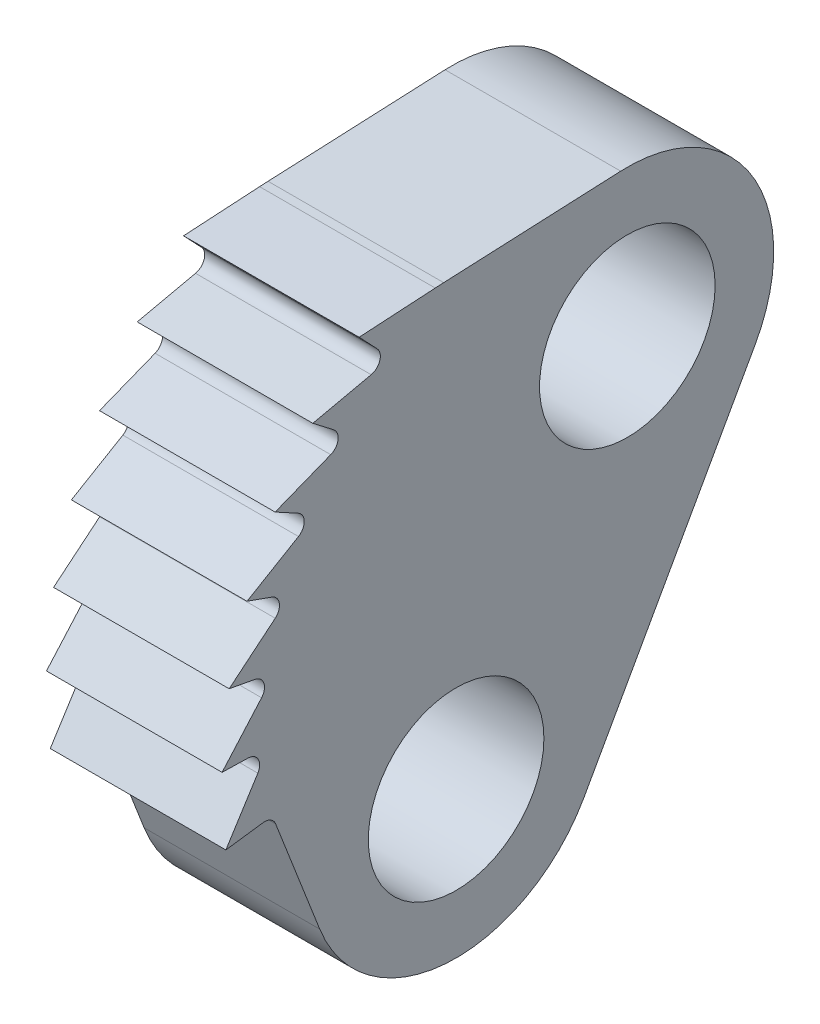
ISO-10303-21;
HEADER;
FILE_DESCRIPTION(('STEP AP214'),'2;1');
FILE_NAME('part.step','',(''),(''),'','','');
FILE_SCHEMA(('AUTOMOTIVE_DESIGN { 1 0 10303 214 1 1 1 1 }'));
ENDSEC;
DATA;
#1=APPLICATION_CONTEXT('core data for automotive mechanical design processes');
#2=APPLICATION_PROTOCOL_DEFINITION('international standard','automotive_design',2000,#1);
#3=PRODUCT_CONTEXT('',#1,'mechanical');
#4=PRODUCT('Part','Part','',(#3));
#5=PRODUCT_RELATED_PRODUCT_CATEGORY('part','',(#4));
#6=PRODUCT_DEFINITION_FORMATION('','',#4);
#7=PRODUCT_DEFINITION_CONTEXT('part definition',#1,'design');
#8=PRODUCT_DEFINITION('design','',#6,#7);
#9=PRODUCT_DEFINITION_SHAPE('','',#8);
#10=(LENGTH_UNIT() NAMED_UNIT(*) SI_UNIT(.MILLI.,.METRE.));
#11=(NAMED_UNIT(*) PLANE_ANGLE_UNIT() SI_UNIT($,.RADIAN.));
#12=(NAMED_UNIT(*) SI_UNIT($,.STERADIAN.) SOLID_ANGLE_UNIT());
#13=UNCERTAINTY_MEASURE_WITH_UNIT(LENGTH_MEASURE(1.E-05),#10,'distance_accuracy_value','');
#14=(GEOMETRIC_REPRESENTATION_CONTEXT(3) GLOBAL_UNCERTAINTY_ASSIGNED_CONTEXT((#13)) GLOBAL_UNIT_ASSIGNED_CONTEXT((#10,
#11,#12)) REPRESENTATION_CONTEXT('',''));
#15=CARTESIAN_POINT('',(0.,0.,0.));
#16=DIRECTION('',(0.,0.,1.));
#17=DIRECTION('',(1.,0.,0.));
#18=AXIS2_PLACEMENT_3D('',#15,#16,#17);
#19=CARTESIAN_POINT('',(3.,-42.7343691654933,-38.9249991557742));
#20=DIRECTION('',(1.,0.,0.));
#21=DIRECTION('',(0.,0.,-1.));
#22=AXIS2_PLACEMENT_3D('',#19,#20,#21);
#23=PLANE('',#22);
#24=CARTESIAN_POINT('',(3.,-42.7343691654933,-38.9249991557742));
#25=DIRECTION('',(1.,0.,0.));
#26=DIRECTION('',(0.,0.,-1.));
#27=AXIS2_PLACEMENT_3D('',#24,#25,#26);
#28=CIRCLE('',#27,1.5);
#29=CARTESIAN_POINT('',(3.,-42.7343691654933,-40.4249991557742));
#30=VERTEX_POINT('',#29);
#31=EDGE_CURVE('E268',#30,#30,#28,.T.);
#32=ORIENTED_EDGE('',*,*,#31,.F.);
#33=EDGE_LOOP('',(#32));
#34=FACE_BOUND('',#33,.T.);
#35=DIRECTION('',(0.,-0.0454217464709889,0.998967899858412));
#36=VECTOR('',#35,1.);
#37=CARTESIAN_POINT('',(3.,-40.3777241266152,-35.7153635488899));
#38=LINE('',#37,#36);
#39=CARTESIAN_POINT('',(3.,-40.2369494158473,-38.8114447895967));
#40=VERTEX_POINT('',#39);
#41=CARTESIAN_POINT('',(3.,-40.3744405098739,-35.7875806689886));
#42=VERTEX_POINT('',#41);
#43=EDGE_CURVE('E245',#40,#42,#38,.T.);
#44=ORIENTED_EDGE('',*,*,#43,.T.);
#45=CARTESIAN_POINT('',(3.,-50.364119508458,-36.2417981336986));
#46=DIRECTION('',(1.,0.,0.));
#47=DIRECTION('',(0.,0.,-1.));
#48=AXIS2_PLACEMENT_3D('',#45,#46,#47);
#49=CIRCLE('',#48,10.);
#50=CARTESIAN_POINT('',(3.,-40.382051485744,-35.6432014498545));
#51=VERTEX_POINT('',#50);
#52=EDGE_CURVE('E343',#42,#51,#49,.T.);
#53=ORIENTED_EDGE('',*,*,#52,.T.);
#54=DIRECTION('',(0.,-0.0598596683844021,0.998206802271408));
#55=VECTOR('',#54,1.);
#56=CARTESIAN_POINT('',(3.,-40.4599715138505,-34.3438240194672));
#57=LINE('',#56,#55);
#58=CARTESIAN_POINT('',(3.,-40.4599715138505,-34.3438240194672));
#59=VERTEX_POINT('',#58);
#60=EDGE_CURVE('E247',#51,#59,#57,.T.);
#61=ORIENTED_EDGE('',*,*,#60,.T.);
#62=DIRECTION('',(0.,-0.726193720806137,-0.687490130737699));
#63=VECTOR('',#62,1.);
#64=CARTESIAN_POINT('',(3.,-41.0409264904954,-34.8938161240574));
#65=LINE('',#64,#63);
#66=CARTESIAN_POINT('',(3.,-40.7844185622066,-34.650979172839));
#67=VERTEX_POINT('',#66);
#68=EDGE_CURVE('E249',#59,#67,#65,.T.);
#69=ORIENTED_EDGE('',*,*,#68,.T.);
#70=CARTESIAN_POINT('',(3.,-40.9219165883542,-34.5057404286777));
#71=DIRECTION('',(1.,0.,0.));
#72=DIRECTION('',(0.,0.,-1.));
#73=AXIS2_PLACEMENT_3D('',#70,#71,#72);
#74=CIRCLE('',#73,0.2);
#75=CARTESIAN_POINT('',(3.,-41.117198297231,-34.5489267017068));
#76=VERTEX_POINT('',#75);
#77=EDGE_CURVE('E379',#67,#76,#74,.F.);
#78=ORIENTED_EDGE('',*,*,#77,.T.);
#79=DIRECTION('',(0.,-0.215931365144971,0.97640854438428));
#80=VECTOR('',#79,1.);
#81=CARTESIAN_POINT('',(3.,-41.3376169180347,-33.5522274748499));
#82=LINE('',#81,#80);
#83=CARTESIAN_POINT('',(3.,-41.3376169180347,-33.5522274748499));
#84=VERTEX_POINT('',#83);
#85=EDGE_CURVE('E252',#76,#84,#82,.T.);
#86=ORIENTED_EDGE('',*,*,#85,.T.);
#87=DIRECTION('',(0.,-0.60917433358158,-0.793036336686685));
#88=VECTOR('',#87,1.);
#89=CARTESIAN_POINT('',(3.,-41.8249563849,-34.1866565441992));
#90=LINE('',#89,#88);
#91=CARTESIAN_POINT('',(3.,-41.6097823317558,-33.9065383030838));
#92=VERTEX_POINT('',#91);
#93=EDGE_CURVE('E254',#84,#92,#90,.T.);
#94=ORIENTED_EDGE('',*,*,#93,.T.);
#95=CARTESIAN_POINT('',(3.,-41.7683895990931,-33.7847034363675));
#96=DIRECTION('',(1.,0.,0.));
#97=DIRECTION('',(0.,0.,-1.));
#98=AXIS2_PLACEMENT_3D('',#95,#96,#97);
#99=CIRCLE('',#98,0.2);
#100=CARTESIAN_POINT('',(3.,-41.9544621205419,-33.8580315807714));
#101=VERTEX_POINT('',#100);
#102=EDGE_CURVE('E383',#92,#101,#99,.F.);
#103=ORIENTED_EDGE('',*,*,#102,.T.);
#104=DIRECTION('',(0.,-0.366640722019304,0.930362607243629));
#105=VECTOR('',#104,1.);
#106=CARTESIAN_POINT('',(3.,-42.3287219795656,-32.9083351686808));
#107=LINE('',#106,#105);
#108=CARTESIAN_POINT('',(3.,-42.3287219795656,-32.9083351686808));
#109=VERTEX_POINT('',#108);
#110=EDGE_CURVE('E257',#101,#109,#107,.T.);
#111=ORIENTED_EDGE('',*,*,#110,.T.);
#112=DIRECTION('',(0.,-0.47702699204412,-0.878888644175893));
#113=VECTOR('',#112,1.);
#114=CARTESIAN_POINT('',(3.,-42.710343573201,-33.6114460840215));
#115=LINE('',#114,#113);
#116=CARTESIAN_POINT('',(3.,-42.5418469283508,-33.3010028801559));
#117=VERTEX_POINT('',#116);
#118=EDGE_CURVE('E259',#109,#117,#115,.T.);
#119=ORIENTED_EDGE('',*,*,#118,.T.);
#120=CARTESIAN_POINT('',(3.,-42.7176246571859,-33.2055974817471));
#121=DIRECTION('',(1.,0.,0.));
#122=DIRECTION('',(0.,0.,-1.));
#123=AXIS2_PLACEMENT_3D('',#120,#121,#122);
#124=CIRCLE('',#123,0.2);
#125=CARTESIAN_POINT('',(3.,-42.8898671520671,-33.3072465002231));
#126=VERTEX_POINT('',#125);
#127=EDGE_CURVE('E387',#117,#126,#124,.F.);
#128=ORIENTED_EDGE('',*,*,#127,.T.);
#129=DIRECTION('',(0.,-0.508245092379615,0.861212474405728));
#130=VECTOR('',#129,1.);
#131=CARTESIAN_POINT('',(3.,-43.4086740526642,-32.4281372253846));
#132=LINE('',#131,#130);
#133=CARTESIAN_POINT('',(3.,-43.4086740526642,-32.4281372253846));
#134=VERTEX_POINT('',#133);
#135=EDGE_CURVE('E262',#126,#134,#132,.T.);
#136=ORIENTED_EDGE('',*,*,#135,.T.);
#137=DIRECTION('',(0.,-0.333033382297636,-0.942915036615387));
#138=VECTOR('',#137,1.);
#139=CARTESIAN_POINT('',(3.,-43.6751007585023,-33.1824692546769));
#140=LINE('',#139,#138);
#141=CARTESIAN_POINT('',(3.,-43.5574658898762,-32.8494104913402));
#142=VERTEX_POINT('',#141);
#143=EDGE_CURVE('E209',#134,#142,#140,.T.);
#144=ORIENTED_EDGE('',*,*,#143,.T.);
#145=CARTESIAN_POINT('',(3.,-43.7460488971992,-32.7828038148807));
#146=DIRECTION('',(1.,0.,0.));
#147=DIRECTION('',(0.,0.,-1.));
#148=AXIS2_PLACEMENT_3D('',#145,#146,#147);
#149=CIRCLE('',#148,0.2);
#150=CARTESIAN_POINT('',(3.,-43.9001839748717,-32.9102494026071));
#151=VERTEX_POINT('',#150);
#152=EDGE_CURVE('E205',#142,#151,#149,.F.);
#153=ORIENTED_EDGE('',*,*,#152,.T.);
#154=DIRECTION('',(0.,-0.637227938631926,0.770675388361991));
#155=VECTOR('',#154,1.);
#156=CARTESIAN_POINT('',(3.,-44.5506541058624,-32.1235586591105));
#157=LINE('',#156,#155);
#158=CARTESIAN_POINT('',(3.,-44.5506541058624,-32.1235586591105));
#159=VERTEX_POINT('',#158);
#160=EDGE_CURVE('E196',#151,#159,#157,.T.);
#161=ORIENTED_EDGE('',*,*,#160,.T.);
#162=DIRECTION('',(0.,-0.180769375204567,-0.983525512118598));
#163=VECTOR('',#162,1.);
#164=CARTESIAN_POINT('',(3.,-44.695269606026,-32.9103790688054));
#165=LINE('',#164,#163);
#166=CARTESIAN_POINT('',(3.,-44.6314178036718,-32.5629757736452));
#167=VERTEX_POINT('',#166);
#168=EDGE_CURVE('E201',#159,#167,#165,.T.);
#169=ORIENTED_EDGE('',*,*,#168,.T.);
#170=CARTESIAN_POINT('',(3.,-44.8281229060955,-32.5268218986042));
#171=DIRECTION('',(1.,0.,0.));
#172=DIRECTION('',(0.,0.,-1.));
#173=AXIS2_PLACEMENT_3D('',#170,#171,#172);
#174=CIRCLE('',#173,0.2);
#175=CARTESIAN_POINT('',(3.,-44.9603228471617,-32.6768991306618));
#176=VERTEX_POINT('',#175);
#177=EDGE_CURVE('E398',#167,#176,#174,.F.);
#178=ORIENTED_EDGE('',*,*,#177,.T.);
#179=DIRECTION('',(0.,-0.750386160288113,0.660999705331298));
#180=VECTOR('',#179,1.);
#181=CARTESIAN_POINT('',(3.,-45.7263027334551,-32.0021632334337));
#182=LINE('',#181,#180);
#183=CARTESIAN_POINT('',(3.,-45.7263027334551,-32.0021632334337));
#184=VERTEX_POINT('',#183);
#185=EDGE_CURVE('E225',#176,#184,#182,.T.);
#186=ORIENTED_EDGE('',*,*,#185,.T.);
#187=DIRECTION('',(0.,-0.0240162248588746,-0.999711568875507));
#188=VECTOR('',#187,1.);
#189=CARTESIAN_POINT('',(3.,-45.7455157133422,-32.8019324885341));
#190=LINE('',#189,#188);
#191=CARTESIAN_POINT('',(3.,-45.7370326434569,-32.4488119146824));
#192=VERTEX_POINT('',#191);
#193=EDGE_CURVE('E227',#184,#192,#190,.T.);
#194=ORIENTED_EDGE('',*,*,#193,.T.);
#195=CARTESIAN_POINT('',(3.,-45.936974957232,-32.4440086697105));
#196=DIRECTION('',(1.,0.,0.));
#197=DIRECTION('',(0.,0.,-1.));
#198=AXIS2_PLACEMENT_3D('',#195,#196,#197);
#199=CIRCLE('',#198,0.2);
#200=CARTESIAN_POINT('',(3.,-46.0439567693558,-32.6129905973676));
#201=VERTEX_POINT('',#200);
#202=EDGE_CURVE('E11',#192,#201,#199,.F.);
#203=ORIENTED_EDGE('',*,*,#202,.T.);
#204=DIRECTION('',(0.,-0.844909638285405,0.534909060619117));
#205=VECTOR('',#204,1.);
#206=CARTESIAN_POINT('',(3.,-46.9064244198965,-32.0669656263407));
#207=LINE('',#206,#205);
#208=CARTESIAN_POINT('',(3.,-46.9064244198965,-32.0669656263407));
#209=VERTEX_POINT('',#208);
#210=EDGE_CURVE('E232',#201,#209,#207,.T.);
#211=ORIENTED_EDGE('',*,*,#210,.T.);
#212=DIRECTION('',(0.,0.133333333333322,-0.991071249821235));
#213=VECTOR('',#212,1.);
#214=CARTESIAN_POINT('',(3.,-46.7997577532299,-32.8598226261977));
#215=LINE('',#214,#213);
#216=CARTESIAN_POINT('',(3.,-46.8207333979614,-32.7039099378987));
#217=VERTEX_POINT('',#216);
#218=EDGE_CURVE('E234',#209,#217,#215,.T.);
#219=ORIENTED_EDGE('',*,*,#218,.T.);
#220=CARTESIAN_POINT('',(3.,-47.0189476479256,-32.7305766045654));
#221=DIRECTION('',(1.,0.,0.));
#222=DIRECTION('',(0.,0.,-1.));
#223=AXIS2_PLACEMENT_3D('',#220,#221,#222);
#224=CIRCLE('',#223,0.2);
#225=CARTESIAN_POINT('',(3.,-46.9463428753062,-32.9169325730582));
#226=VERTEX_POINT('',#225);
#227=EDGE_CURVE('E391',#217,#226,#224,.F.);
#228=ORIENTED_EDGE('',*,*,#227,.T.);
#229=DIRECTION('',(0.,-0.931779842463877,-0.36302386309717));
#230=VECTOR('',#229,1.);
#231=CARTESIAN_POINT('',(3.,-46.7997577532299,-32.8598226261977));
#232=LINE('',#231,#230);
#233=CARTESIAN_POINT('',(3.,-48.8806672151318,-33.6705503938403));
#234=VERTEX_POINT('',#233);
#235=EDGE_CURVE('E237',#226,#234,#232,.T.);
#236=ORIENTED_EDGE('',*,*,#235,.T.);
#237=CARTESIAN_POINT('',(3.,-47.9731075573889,-36.));
#238=DIRECTION('',(1.,0.,0.));
#239=DIRECTION('',(0.,0.,-1.));
#240=AXIS2_PLACEMENT_3D('',#237,#238,#239);
#241=CIRCLE('',#240,2.5);
#242=CARTESIAN_POINT('',(3.,-49.1918572056281,-38.1828076632898));
#243=VERTEX_POINT('',#242);
#244=EDGE_CURVE('E239',#234,#243,#241,.T.);
#245=ORIENTED_EDGE('',*,*,#244,.T.);
#246=DIRECTION('',(0.,0.87312306531592,-0.487499859295704));
#247=VECTOR('',#246,1.);
#248=CARTESIAN_POINT('',(3.,-49.1918572056281,-38.1828076632898));
#249=LINE('',#248,#247);
#250=CARTESIAN_POINT('',(3.,-43.9531188137326,-41.107806819064));
#251=VERTEX_POINT('',#250);
#252=EDGE_CURVE('E241',#243,#251,#249,.T.);
#253=ORIENTED_EDGE('',*,*,#252,.T.);
#254=CARTESIAN_POINT('',(3.,-42.7343691654933,-38.9249991557742));
#255=DIRECTION('',(1.,0.,0.));
#256=DIRECTION('',(0.,0.,-1.));
#257=AXIS2_PLACEMENT_3D('',#254,#255,#256);
#258=CIRCLE('',#257,2.5);
#259=EDGE_CURVE('E243',#251,#40,#258,.T.);
#260=ORIENTED_EDGE('',*,*,#259,.T.);
#261=EDGE_LOOP('',(#44,#53,#61,#69,#78,#86,#94,#103,#111,#119,#128,#136,#144,#153,#161,#169,
#178,#186,#194,#203,#211,#219,#228,#236,#245,#253,#260));
#262=FACE_BOUND('',#261,.T.);
#263=CARTESIAN_POINT('',(3.,-47.9731075573889,-36.));
#264=DIRECTION('',(1.,0.,0.));
#265=DIRECTION('',(0.,0.,-1.));
#266=AXIS2_PLACEMENT_3D('',#263,#264,#265);
#267=CIRCLE('',#266,1.5);
#268=CARTESIAN_POINT('',(3.,-47.9731075573889,-37.5));
#269=VERTEX_POINT('',#268);
#270=EDGE_CURVE('E511',#269,#269,#267,.T.);
#271=ORIENTED_EDGE('',*,*,#270,.F.);
#272=EDGE_LOOP('',(#271));
#273=FACE_BOUND('',#272,.T.);
#274=ADVANCED_FACE('F17',(#34,#262,#273),#23,.T.);
#275=CARTESIAN_POINT('',(0.,-42.7343691654933,-38.9249991557742));
#276=DIRECTION('',(1.,0.,0.));
#277=DIRECTION('',(0.,0.,-1.));
#278=AXIS2_PLACEMENT_3D('',#275,#276,#277);
#279=PLANE('',#278);
#280=DIRECTION('',(0.,-0.0598596683844021,0.998206802271408));
#281=VECTOR('',#280,1.);
#282=CARTESIAN_POINT('',(0.,-40.4599715138505,-34.3438240194672));
#283=LINE('',#282,#281);
#284=CARTESIAN_POINT('',(0.,-40.382051485744,-35.6432014498545));
#285=VERTEX_POINT('',#284);
#286=CARTESIAN_POINT('',(0.,-40.4599715138505,-34.3438240194672));
#287=VERTEX_POINT('',#286);
#288=EDGE_CURVE('E292',#285,#287,#283,.T.);
#289=ORIENTED_EDGE('',*,*,#288,.F.);
#290=CARTESIAN_POINT('',(0.,-50.364119508458,-36.2417981336986));
#291=DIRECTION('',(1.,0.,0.));
#292=DIRECTION('',(0.,0.,-1.));
#293=AXIS2_PLACEMENT_3D('',#290,#291,#292);
#294=CIRCLE('',#293,10.);
#295=CARTESIAN_POINT('',(0.,-40.3744405098739,-35.7875806689886));
#296=VERTEX_POINT('',#295);
#297=EDGE_CURVE('E339',#285,#296,#294,.F.);
#298=ORIENTED_EDGE('',*,*,#297,.T.);
#299=DIRECTION('',(0.,-0.0454217464709889,0.998967899858412));
#300=VECTOR('',#299,1.);
#301=CARTESIAN_POINT('',(0.,-40.3777241266152,-35.7153635488899));
#302=LINE('',#301,#300);
#303=CARTESIAN_POINT('',(0.,-40.2369494158473,-38.8114447895967));
#304=VERTEX_POINT('',#303);
#305=EDGE_CURVE('E289',#304,#296,#302,.T.);
#306=ORIENTED_EDGE('',*,*,#305,.F.);
#307=CARTESIAN_POINT('',(0.,-42.7343691654933,-38.9249991557742));
#308=DIRECTION('',(1.,0.,0.));
#309=DIRECTION('',(0.,0.,-1.));
#310=AXIS2_PLACEMENT_3D('',#307,#308,#309);
#311=CIRCLE('',#310,2.5);
#312=CARTESIAN_POINT('',(0.,-43.9531188137326,-41.107806819064));
#313=VERTEX_POINT('',#312);
#314=EDGE_CURVE('E287',#313,#304,#311,.T.);
#315=ORIENTED_EDGE('',*,*,#314,.F.);
#316=DIRECTION('',(0.,0.87312306531592,-0.487499859295704));
#317=VECTOR('',#316,1.);
#318=CARTESIAN_POINT('',(0.,-49.1918572056281,-38.1828076632898));
#319=LINE('',#318,#317);
#320=CARTESIAN_POINT('',(0.,-49.1918572056281,-38.1828076632898));
#321=VERTEX_POINT('',#320);
#322=EDGE_CURVE('E285',#321,#313,#319,.T.);
#323=ORIENTED_EDGE('',*,*,#322,.F.);
#324=CARTESIAN_POINT('',(0.,-47.9731075573889,-36.));
#325=DIRECTION('',(1.,0.,0.));
#326=DIRECTION('',(0.,0.,-1.));
#327=AXIS2_PLACEMENT_3D('',#324,#325,#326);
#328=CIRCLE('',#327,2.5);
#329=CARTESIAN_POINT('',(0.,-48.8806672151318,-33.6705503938403));
#330=VERTEX_POINT('',#329);
#331=EDGE_CURVE('E283',#330,#321,#328,.T.);
#332=ORIENTED_EDGE('',*,*,#331,.F.);
#333=DIRECTION('',(0.,-0.931779842463877,-0.36302386309717));
#334=VECTOR('',#333,1.);
#335=CARTESIAN_POINT('',(0.,-46.7997577532299,-32.8598226261977));
#336=LINE('',#335,#334);
#337=CARTESIAN_POINT('',(0.,-46.9463428753062,-32.9169325730582));
#338=VERTEX_POINT('',#337);
#339=EDGE_CURVE('E281',#338,#330,#336,.T.);
#340=ORIENTED_EDGE('',*,*,#339,.F.);
#341=CARTESIAN_POINT('',(0.,-47.0189476479256,-32.7305766045654));
#342=DIRECTION('',(1.,0.,0.));
#343=DIRECTION('',(0.,0.,-1.));
#344=AXIS2_PLACEMENT_3D('',#341,#342,#343);
#345=CIRCLE('',#344,0.2);
#346=CARTESIAN_POINT('',(0.,-46.8207333979614,-32.7039099378987));
#347=VERTEX_POINT('',#346);
#348=EDGE_CURVE('E389',#338,#347,#345,.T.);
#349=ORIENTED_EDGE('',*,*,#348,.T.);
#350=DIRECTION('',(0.,0.133333333333322,-0.991071249821235));
#351=VECTOR('',#350,1.);
#352=CARTESIAN_POINT('',(0.,-46.7997577532299,-32.8598226261977));
#353=LINE('',#352,#351);
#354=CARTESIAN_POINT('',(0.,-46.9064244198965,-32.0669656263407));
#355=VERTEX_POINT('',#354);
#356=EDGE_CURVE('E278',#355,#347,#353,.T.);
#357=ORIENTED_EDGE('',*,*,#356,.F.);
#358=DIRECTION('',(0.,-0.844909638285405,0.534909060619117));
#359=VECTOR('',#358,1.);
#360=CARTESIAN_POINT('',(0.,-46.9064244198965,-32.0669656263407));
#361=LINE('',#360,#359);
#362=CARTESIAN_POINT('',(0.,-46.0439567693558,-32.6129905973676));
#363=VERTEX_POINT('',#362);
#364=EDGE_CURVE('E276',#363,#355,#361,.T.);
#365=ORIENTED_EDGE('',*,*,#364,.F.);
#366=CARTESIAN_POINT('',(0.,-45.936974957232,-32.4440086697105));
#367=DIRECTION('',(1.,0.,0.));
#368=DIRECTION('',(0.,0.,-1.));
#369=AXIS2_PLACEMENT_3D('',#366,#367,#368);
#370=CIRCLE('',#369,0.2);
#371=CARTESIAN_POINT('',(0.,-45.7370326434569,-32.4488119146824));
#372=VERTEX_POINT('',#371);
#373=EDGE_CURVE('E25',#363,#372,#370,.T.);
#374=ORIENTED_EDGE('',*,*,#373,.T.);
#375=DIRECTION('',(0.,-0.0240162248588746,-0.999711568875507));
#376=VECTOR('',#375,1.);
#377=CARTESIAN_POINT('',(0.,-45.7455157133422,-32.8019324885341));
#378=LINE('',#377,#376);
#379=CARTESIAN_POINT('',(0.,-45.7263027334551,-32.0021632334337));
#380=VERTEX_POINT('',#379);
#381=EDGE_CURVE('E274',#380,#372,#378,.T.);
#382=ORIENTED_EDGE('',*,*,#381,.F.);
#383=DIRECTION('',(0.,-0.750386160288113,0.660999705331298));
#384=VECTOR('',#383,1.);
#385=CARTESIAN_POINT('',(0.,-45.7263027334551,-32.0021632334337));
#386=LINE('',#385,#384);
#387=CARTESIAN_POINT('',(0.,-44.9603228471617,-32.6768991306618));
#388=VERTEX_POINT('',#387);
#389=EDGE_CURVE('E272',#388,#380,#386,.T.);
#390=ORIENTED_EDGE('',*,*,#389,.F.);
#391=CARTESIAN_POINT('',(0.,-44.8281229060955,-32.5268218986042));
#392=DIRECTION('',(1.,0.,0.));
#393=DIRECTION('',(0.,0.,-1.));
#394=AXIS2_PLACEMENT_3D('',#391,#392,#393);
#395=CIRCLE('',#394,0.2);
#396=CARTESIAN_POINT('',(0.,-44.6314178036718,-32.5629757736452));
#397=VERTEX_POINT('',#396);
#398=EDGE_CURVE('E396',#388,#397,#395,.T.);
#399=ORIENTED_EDGE('',*,*,#398,.T.);
#400=DIRECTION('',(0.,-0.180769375204567,-0.983525512118598));
#401=VECTOR('',#400,1.);
#402=CARTESIAN_POINT('',(0.,-44.695269606026,-32.9103790688054));
#403=LINE('',#402,#401);
#404=CARTESIAN_POINT('',(0.,-44.5506541058624,-32.1235586591105));
#405=VERTEX_POINT('',#404);
#406=EDGE_CURVE('E270',#405,#397,#403,.T.);
#407=ORIENTED_EDGE('',*,*,#406,.F.);
#408=DIRECTION('',(0.,-0.637227938631926,0.770675388361991));
#409=VECTOR('',#408,1.);
#410=CARTESIAN_POINT('',(0.,-44.5506541058624,-32.1235586591105));
#411=LINE('',#410,#409);
#412=CARTESIAN_POINT('',(0.,-43.9001839748717,-32.9102494026071));
#413=VERTEX_POINT('',#412);
#414=EDGE_CURVE('E215',#413,#405,#411,.T.);
#415=ORIENTED_EDGE('',*,*,#414,.F.);
#416=CARTESIAN_POINT('',(0.,-43.7460488971992,-32.7828038148807));
#417=DIRECTION('',(1.,0.,0.));
#418=DIRECTION('',(0.,0.,-1.));
#419=AXIS2_PLACEMENT_3D('',#416,#417,#418);
#420=CIRCLE('',#419,0.2);
#421=CARTESIAN_POINT('',(0.,-43.5574658898762,-32.8494104913402));
#422=VERTEX_POINT('',#421);
#423=EDGE_CURVE('E393',#413,#422,#420,.T.);
#424=ORIENTED_EDGE('',*,*,#423,.T.);
#425=DIRECTION('',(0.,-0.333033382297636,-0.942915036615387));
#426=VECTOR('',#425,1.);
#427=CARTESIAN_POINT('',(0.,-43.6751007585023,-33.1824692546769));
#428=LINE('',#427,#426);
#429=CARTESIAN_POINT('',(0.,-43.4086740526642,-32.4281372253846));
#430=VERTEX_POINT('',#429);
#431=EDGE_CURVE('E265',#430,#422,#428,.T.);
#432=ORIENTED_EDGE('',*,*,#431,.F.);
#433=DIRECTION('',(0.,-0.508245092379615,0.861212474405728));
#434=VECTOR('',#433,1.);
#435=CARTESIAN_POINT('',(0.,-43.4086740526642,-32.4281372253846));
#436=LINE('',#435,#434);
#437=CARTESIAN_POINT('',(0.,-42.8898671520671,-33.3072465002231));
#438=VERTEX_POINT('',#437);
#439=EDGE_CURVE('E307',#438,#430,#436,.T.);
#440=ORIENTED_EDGE('',*,*,#439,.F.);
#441=CARTESIAN_POINT('',(0.,-42.7176246571859,-33.2055974817471));
#442=DIRECTION('',(1.,0.,0.));
#443=DIRECTION('',(0.,0.,-1.));
#444=AXIS2_PLACEMENT_3D('',#441,#442,#443);
#445=CIRCLE('',#444,0.2);
#446=CARTESIAN_POINT('',(0.,-42.5418469283508,-33.3010028801559));
#447=VERTEX_POINT('',#446);
#448=EDGE_CURVE('E385',#438,#447,#445,.T.);
#449=ORIENTED_EDGE('',*,*,#448,.T.);
#450=DIRECTION('',(0.,-0.47702699204412,-0.878888644175893));
#451=VECTOR('',#450,1.);
#452=CARTESIAN_POINT('',(0.,-42.710343573201,-33.6114460840215));
#453=LINE('',#452,#451);
#454=CARTESIAN_POINT('',(0.,-42.3287219795656,-32.9083351686808));
#455=VERTEX_POINT('',#454);
#456=EDGE_CURVE('E304',#455,#447,#453,.T.);
#457=ORIENTED_EDGE('',*,*,#456,.F.);
#458=DIRECTION('',(0.,-0.366640722019304,0.930362607243629));
#459=VECTOR('',#458,1.);
#460=CARTESIAN_POINT('',(0.,-42.3287219795656,-32.9083351686808));
#461=LINE('',#460,#459);
#462=CARTESIAN_POINT('',(0.,-41.9544621205419,-33.8580315807714));
#463=VERTEX_POINT('',#462);
#464=EDGE_CURVE('E302',#463,#455,#461,.T.);
#465=ORIENTED_EDGE('',*,*,#464,.F.);
#466=CARTESIAN_POINT('',(0.,-41.7683895990931,-33.7847034363675));
#467=DIRECTION('',(1.,0.,0.));
#468=DIRECTION('',(0.,0.,-1.));
#469=AXIS2_PLACEMENT_3D('',#466,#467,#468);
#470=CIRCLE('',#469,0.2);
#471=CARTESIAN_POINT('',(0.,-41.6097823317558,-33.9065383030838));
#472=VERTEX_POINT('',#471);
#473=EDGE_CURVE('E381',#463,#472,#470,.T.);
#474=ORIENTED_EDGE('',*,*,#473,.T.);
#475=DIRECTION('',(0.,-0.60917433358158,-0.793036336686685));
#476=VECTOR('',#475,1.);
#477=CARTESIAN_POINT('',(0.,-41.8249563849,-34.1866565441992));
#478=LINE('',#477,#476);
#479=CARTESIAN_POINT('',(0.,-41.3376169180347,-33.5522274748499));
#480=VERTEX_POINT('',#479);
#481=EDGE_CURVE('E299',#480,#472,#478,.T.);
#482=ORIENTED_EDGE('',*,*,#481,.F.);
#483=DIRECTION('',(0.,-0.215931365144971,0.97640854438428));
#484=VECTOR('',#483,1.);
#485=CARTESIAN_POINT('',(0.,-41.3376169180347,-33.5522274748499));
#486=LINE('',#485,#484);
#487=CARTESIAN_POINT('',(0.,-41.117198297231,-34.5489267017068));
#488=VERTEX_POINT('',#487);
#489=EDGE_CURVE('E297',#488,#480,#486,.T.);
#490=ORIENTED_EDGE('',*,*,#489,.F.);
#491=CARTESIAN_POINT('',(0.,-40.9219165883542,-34.5057404286777));
#492=DIRECTION('',(1.,0.,0.));
#493=DIRECTION('',(0.,0.,-1.));
#494=AXIS2_PLACEMENT_3D('',#491,#492,#493);
#495=CIRCLE('',#494,0.2);
#496=CARTESIAN_POINT('',(0.,-40.7844185622066,-34.650979172839));
#497=VERTEX_POINT('',#496);
#498=EDGE_CURVE('E377',#488,#497,#495,.T.);
#499=ORIENTED_EDGE('',*,*,#498,.T.);
#500=DIRECTION('',(0.,-0.726193720806137,-0.687490130737699));
#501=VECTOR('',#500,1.);
#502=CARTESIAN_POINT('',(0.,-41.0409264904954,-34.8938161240574));
#503=LINE('',#502,#501);
#504=EDGE_CURVE('E294',#287,#497,#503,.T.);
#505=ORIENTED_EDGE('',*,*,#504,.F.);
#506=EDGE_LOOP('',(#289,#298,#306,#315,#323,#332,#340,#349,#357,#365,#374,#382,#390,#399,#407,
#415,#424,#432,#440,#449,#457,#465,#474,#482,#490,#499,#505));
#507=FACE_BOUND('',#506,.T.);
#508=CARTESIAN_POINT('',(0.,-42.7343691654933,-38.9249991557742));
#509=DIRECTION('',(1.,0.,0.));
#510=DIRECTION('',(0.,0.,-1.));
#511=AXIS2_PLACEMENT_3D('',#508,#509,#510);
#512=CIRCLE('',#511,1.5);
#513=CARTESIAN_POINT('',(0.,-42.7343691654933,-40.4249991557742));
#514=VERTEX_POINT('',#513);
#515=EDGE_CURVE('E508',#514,#514,#512,.T.);
#516=ORIENTED_EDGE('',*,*,#515,.T.);
#517=EDGE_LOOP('',(#516));
#518=FACE_BOUND('',#517,.T.);
#519=CARTESIAN_POINT('',(0.,-47.9731075573889,-36.));
#520=DIRECTION('',(1.,0.,0.));
#521=DIRECTION('',(0.,0.,-1.));
#522=AXIS2_PLACEMENT_3D('',#519,#520,#521);
#523=CIRCLE('',#522,1.5);
#524=CARTESIAN_POINT('',(0.,-47.9731075573889,-37.5));
#525=VERTEX_POINT('',#524);
#526=EDGE_CURVE('E514',#525,#525,#523,.T.);
#527=ORIENTED_EDGE('',*,*,#526,.T.);
#528=EDGE_LOOP('',(#527));
#529=FACE_BOUND('',#528,.T.);
#530=ADVANCED_FACE('F408',(#507,#518,#529),#279,.F.);
#531=CARTESIAN_POINT('',(3.,-43.6751007585023,-33.1824692546769));
#532=DIRECTION('',(0.,0.942915036615387,-0.333033382297636));
#533=DIRECTION('',(0.,0.333033382297636,0.942915036615387));
#534=AXIS2_PLACEMENT_3D('',#531,#532,#533);
#535=PLANE('',#534);
#536=ORIENTED_EDGE('',*,*,#431,.T.);
#537=DIRECTION('',(-1.,0.,0.));
#538=VECTOR('',#537,1.);
#539=CARTESIAN_POINT('',(3.,-43.5574658898762,-32.8494104913402));
#540=LINE('',#539,#538);
#541=EDGE_CURVE('E367',#422,#142,#540,.F.);
#542=ORIENTED_EDGE('',*,*,#541,.T.);
#543=ORIENTED_EDGE('',*,*,#143,.F.);
#544=DIRECTION('',(-1.,0.,0.));
#545=VECTOR('',#544,1.);
#546=CARTESIAN_POINT('',(3.,-43.4086740526642,-32.4281372253846));
#547=LINE('',#546,#545);
#548=EDGE_CURVE('E264',#134,#430,#547,.T.);
#549=ORIENTED_EDGE('',*,*,#548,.T.);
#550=EDGE_LOOP('',(#536,#542,#543,#549));
#551=FACE_BOUND('',#550,.T.);
#552=ADVANCED_FACE('F505',(#551),#535,.F.);
#553=CARTESIAN_POINT('',(3.,-44.5506541058624,-32.1235586591105));
#554=DIRECTION('',(0.,-0.770675388361991,-0.637227938631927));
#555=DIRECTION('',(0.,0.637227938631927,-0.770675388361991));
#556=AXIS2_PLACEMENT_3D('',#553,#554,#555);
#557=PLANE('',#556);
#558=ORIENTED_EDGE('',*,*,#160,.F.);
#559=DIRECTION('',(-1.,0.,0.));
#560=VECTOR('',#559,1.);
#561=CARTESIAN_POINT('',(0.,-43.9001839748717,-32.9102494026071));
#562=LINE('',#561,#560);
#563=EDGE_CURVE('E365',#151,#413,#562,.T.);
#564=ORIENTED_EDGE('',*,*,#563,.T.);
#565=ORIENTED_EDGE('',*,*,#414,.T.);
#566=DIRECTION('',(-1.,0.,0.));
#567=VECTOR('',#566,1.);
#568=CARTESIAN_POINT('',(3.,-44.5506541058624,-32.1235586591105));
#569=LINE('',#568,#567);
#570=EDGE_CURVE('E212',#159,#405,#569,.T.);
#571=ORIENTED_EDGE('',*,*,#570,.F.);
#572=EDGE_LOOP('',(#558,#564,#565,#571));
#573=FACE_BOUND('',#572,.T.);
#574=ADVANCED_FACE('F213',(#573),#557,.F.);
#575=CARTESIAN_POINT('',(3.,-44.695269606026,-32.9103790688054));
#576=DIRECTION('',(0.,0.983525512118598,-0.180769375204567));
#577=DIRECTION('',(0.,0.180769375204567,0.983525512118598));
#578=AXIS2_PLACEMENT_3D('',#575,#576,#577);
#579=PLANE('',#578);
#580=ORIENTED_EDGE('',*,*,#406,.T.);
#581=DIRECTION('',(-1.,0.,0.));
#582=VECTOR('',#581,1.);
#583=CARTESIAN_POINT('',(3.,-44.6314178036718,-32.5629757736452));
#584=LINE('',#583,#582);
#585=EDGE_CURVE('E224',#397,#167,#584,.F.);
#586=ORIENTED_EDGE('',*,*,#585,.T.);
#587=ORIENTED_EDGE('',*,*,#168,.F.);
#588=ORIENTED_EDGE('',*,*,#570,.T.);
#589=EDGE_LOOP('',(#580,#586,#587,#588));
#590=FACE_BOUND('',#589,.T.);
#591=ADVANCED_FACE('F222',(#590),#579,.F.);
#592=CARTESIAN_POINT('',(3.,-45.7263027334551,-32.0021632334337));
#593=DIRECTION('',(0.,-0.660999705331298,-0.750386160288113));
#594=DIRECTION('',(0.,0.750386160288113,-0.660999705331298));
#595=AXIS2_PLACEMENT_3D('',#592,#593,#594);
#596=PLANE('',#595);
#597=ORIENTED_EDGE('',*,*,#185,.F.);
#598=DIRECTION('',(-1.,0.,0.));
#599=VECTOR('',#598,1.);
#600=CARTESIAN_POINT('',(0.,-44.9603228471617,-32.6768991306618));
#601=LINE('',#600,#599);
#602=EDGE_CURVE('E369',#176,#388,#601,.T.);
#603=ORIENTED_EDGE('',*,*,#602,.T.);
#604=ORIENTED_EDGE('',*,*,#389,.T.);
#605=DIRECTION('',(-1.,0.,0.));
#606=VECTOR('',#605,1.);
#607=CARTESIAN_POINT('',(3.,-45.7263027334551,-32.0021632334337));
#608=LINE('',#607,#606);
#609=EDGE_CURVE('E220',#184,#380,#608,.T.);
#610=ORIENTED_EDGE('',*,*,#609,.F.);
#611=EDGE_LOOP('',(#597,#603,#604,#610));
#612=FACE_BOUND('',#611,.T.);
#613=ADVANCED_FACE('F404',(#612),#596,.F.);
#614=CARTESIAN_POINT('',(3.,-45.7455157133422,-32.8019324885341));
#615=DIRECTION('',(0.,0.999711568875507,-0.0240162248588746));
#616=DIRECTION('',(0.,0.0240162248588746,0.999711568875507));
#617=AXIS2_PLACEMENT_3D('',#614,#615,#616);
#618=PLANE('',#617);
#619=ORIENTED_EDGE('',*,*,#381,.T.);
#620=DIRECTION('',(-1.,0.,0.));
#621=VECTOR('',#620,1.);
#622=CARTESIAN_POINT('',(3.,-45.7370326434569,-32.4488119146824));
#623=LINE('',#622,#621);
#624=EDGE_CURVE('E32',#372,#192,#623,.F.);
#625=ORIENTED_EDGE('',*,*,#624,.T.);
#626=ORIENTED_EDGE('',*,*,#193,.F.);
#627=ORIENTED_EDGE('',*,*,#609,.T.);
#628=EDGE_LOOP('',(#619,#625,#626,#627));
#629=FACE_BOUND('',#628,.T.);
#630=ADVANCED_FACE('F410',(#629),#618,.F.);
#631=CARTESIAN_POINT('',(3.,-46.9064244198965,-32.0669656263407));
#632=DIRECTION('',(0.,-0.534909060619117,-0.844909638285405));
#633=DIRECTION('',(0.,0.844909638285405,-0.534909060619117));
#634=AXIS2_PLACEMENT_3D('',#631,#632,#633);
#635=PLANE('',#634);
#636=ORIENTED_EDGE('',*,*,#210,.F.);
#637=DIRECTION('',(-1.,0.,0.));
#638=VECTOR('',#637,1.);
#639=CARTESIAN_POINT('',(0.,-46.0439567693558,-32.6129905973676));
#640=LINE('',#639,#638);
#641=EDGE_CURVE('E373',#201,#363,#640,.T.);
#642=ORIENTED_EDGE('',*,*,#641,.T.);
#643=ORIENTED_EDGE('',*,*,#364,.T.);
#644=DIRECTION('',(-1.,0.,0.));
#645=VECTOR('',#644,1.);
#646=CARTESIAN_POINT('',(3.,-46.9064244198965,-32.0669656263407));
#647=LINE('',#646,#645);
#648=EDGE_CURVE('E332',#209,#355,#647,.T.);
#649=ORIENTED_EDGE('',*,*,#648,.F.);
#650=EDGE_LOOP('',(#636,#642,#643,#649));
#651=FACE_BOUND('',#650,.T.);
#652=ADVANCED_FACE('F416',(#651),#635,.F.);
#653=CARTESIAN_POINT('',(3.,-46.7997577532299,-32.8598226261977));
#654=DIRECTION('',(0.,0.991071249821235,0.133333333333322));
#655=DIRECTION('',(0.,-0.133333333333322,0.991071249821235));
#656=AXIS2_PLACEMENT_3D('',#653,#654,#655);
#657=PLANE('',#656);
#658=ORIENTED_EDGE('',*,*,#356,.T.);
#659=DIRECTION('',(-1.,0.,0.));
#660=VECTOR('',#659,1.);
#661=CARTESIAN_POINT('',(3.,-46.8207333979614,-32.7039099378987));
#662=LINE('',#661,#660);
#663=EDGE_CURVE('E363',#347,#217,#662,.F.);
#664=ORIENTED_EDGE('',*,*,#663,.T.);
#665=ORIENTED_EDGE('',*,*,#218,.F.);
#666=ORIENTED_EDGE('',*,*,#648,.T.);
#667=EDGE_LOOP('',(#658,#664,#665,#666));
#668=FACE_BOUND('',#667,.T.);
#669=ADVANCED_FACE('F422',(#668),#657,.F.);
#670=CARTESIAN_POINT('',(3.,-46.7997577532299,-32.8598226261977));
#671=DIRECTION('',(0.,0.36302386309717,-0.931779842463877));
#672=DIRECTION('',(0.,0.931779842463877,0.36302386309717));
#673=AXIS2_PLACEMENT_3D('',#670,#671,#672);
#674=PLANE('',#673);
#675=ORIENTED_EDGE('',*,*,#235,.F.);
#676=DIRECTION('',(-1.,0.,0.));
#677=VECTOR('',#676,1.);
#678=CARTESIAN_POINT('',(0.,-46.9463428753062,-32.9169325730582));
#679=LINE('',#678,#677);
#680=EDGE_CURVE('E360',#226,#338,#679,.T.);
#681=ORIENTED_EDGE('',*,*,#680,.T.);
#682=ORIENTED_EDGE('',*,*,#339,.T.);
#683=DIRECTION('',(-1.,0.,0.));
#684=VECTOR('',#683,1.);
#685=CARTESIAN_POINT('',(3.,-48.8806672151318,-33.6705503938403));
#686=LINE('',#685,#684);
#687=EDGE_CURVE('E329',#234,#330,#686,.T.);
#688=ORIENTED_EDGE('',*,*,#687,.F.);
#689=EDGE_LOOP('',(#675,#681,#682,#688));
#690=FACE_BOUND('',#689,.T.);
#691=ADVANCED_FACE('F431',(#690),#674,.F.);
#692=CARTESIAN_POINT('',(3.,-47.9731075573889,-36.));
#693=DIRECTION('',(-1.,0.,0.));
#694=DIRECTION('',(0.,0.,1.));
#695=AXIS2_PLACEMENT_3D('',#692,#693,#694);
#696=CYLINDRICAL_SURFACE('',#695,2.5);
#697=ORIENTED_EDGE('',*,*,#331,.T.);
#698=DIRECTION('',(-1.,0.,0.));
#699=VECTOR('',#698,1.);
#700=CARTESIAN_POINT('',(3.,-49.1918572056281,-38.1828076632898));
#701=LINE('',#700,#699);
#702=EDGE_CURVE('E326',#243,#321,#701,.T.);
#703=ORIENTED_EDGE('',*,*,#702,.F.);
#704=ORIENTED_EDGE('',*,*,#244,.F.);
#705=ORIENTED_EDGE('',*,*,#687,.T.);
#706=EDGE_LOOP('',(#697,#703,#704,#705));
#707=FACE_BOUND('',#706,.T.);
#708=ADVANCED_FACE('F436',(#707),#696,.T.);
#709=CARTESIAN_POINT('',(3.,-49.1918572056281,-38.1828076632898));
#710=DIRECTION('',(0.,0.487499859295705,0.87312306531592));
#711=DIRECTION('',(0.,-0.87312306531592,0.487499859295705));
#712=AXIS2_PLACEMENT_3D('',#709,#710,#711);
#713=PLANE('',#712);
#714=ORIENTED_EDGE('',*,*,#322,.T.);
#715=DIRECTION('',(-1.,0.,0.));
#716=VECTOR('',#715,1.);
#717=CARTESIAN_POINT('',(3.,-43.9531188137326,-41.107806819064));
#718=LINE('',#717,#716);
#719=EDGE_CURVE('E323',#251,#313,#718,.T.);
#720=ORIENTED_EDGE('',*,*,#719,.F.);
#721=ORIENTED_EDGE('',*,*,#252,.F.);
#722=ORIENTED_EDGE('',*,*,#702,.T.);
#723=EDGE_LOOP('',(#714,#720,#721,#722));
#724=FACE_BOUND('',#723,.T.);
#725=ADVANCED_FACE('F442',(#724),#713,.F.);
#726=CARTESIAN_POINT('',(3.,-42.7343691654933,-38.9249991557742));
#727=DIRECTION('',(-1.,0.,0.));
#728=DIRECTION('',(0.,0.,1.));
#729=AXIS2_PLACEMENT_3D('',#726,#727,#728);
#730=CYLINDRICAL_SURFACE('',#729,2.5);
#731=ORIENTED_EDGE('',*,*,#314,.T.);
#732=DIRECTION('',(-1.,0.,0.));
#733=VECTOR('',#732,1.);
#734=CARTESIAN_POINT('',(3.,-40.2369494158473,-38.8114447895967));
#735=LINE('',#734,#733);
#736=EDGE_CURVE('E320',#40,#304,#735,.T.);
#737=ORIENTED_EDGE('',*,*,#736,.F.);
#738=ORIENTED_EDGE('',*,*,#259,.F.);
#739=ORIENTED_EDGE('',*,*,#719,.T.);
#740=EDGE_LOOP('',(#731,#737,#738,#739));
#741=FACE_BOUND('',#740,.T.);
#742=ADVANCED_FACE('F446',(#741),#730,.T.);
#743=CARTESIAN_POINT('',(3.,-40.3777241266152,-35.7153635488899));
#744=DIRECTION('',(0.,-0.998967899858411,-0.0454217464709889));
#745=DIRECTION('',(0.,0.0454217464709889,-0.998967899858412));
#746=AXIS2_PLACEMENT_3D('',#743,#744,#745);
#747=PLANE('',#746);
#748=ORIENTED_EDGE('',*,*,#305,.T.);
#749=DIRECTION('',(-1.,0.,0.));
#750=VECTOR('',#749,1.);
#751=CARTESIAN_POINT('',(3.,-40.3744405098739,-35.7875806689886));
#752=LINE('',#751,#750);
#753=EDGE_CURVE('E341',#296,#42,#752,.F.);
#754=ORIENTED_EDGE('',*,*,#753,.T.);
#755=ORIENTED_EDGE('',*,*,#43,.F.);
#756=ORIENTED_EDGE('',*,*,#736,.T.);
#757=EDGE_LOOP('',(#748,#754,#755,#756));
#758=FACE_BOUND('',#757,.T.);
#759=ADVANCED_FACE('F450',(#758),#747,.F.);
#760=CARTESIAN_POINT('',(3.,-40.4599715138505,-34.3438240194672));
#761=DIRECTION('',(0.,-0.998206802271408,-0.0598596683844021));
#762=DIRECTION('',(0.,0.0598596683844021,-0.998206802271408));
#763=AXIS2_PLACEMENT_3D('',#760,#761,#762);
#764=PLANE('',#763);
#765=ORIENTED_EDGE('',*,*,#60,.F.);
#766=DIRECTION('',(-1.,0.,0.));
#767=VECTOR('',#766,1.);
#768=CARTESIAN_POINT('',(3.,-40.382051485744,-35.6432014498545));
#769=LINE('',#768,#767);
#770=EDGE_CURVE('E219',#51,#285,#769,.T.);
#771=ORIENTED_EDGE('',*,*,#770,.T.);
#772=ORIENTED_EDGE('',*,*,#288,.T.);
#773=DIRECTION('',(-1.,0.,0.));
#774=VECTOR('',#773,1.);
#775=CARTESIAN_POINT('',(3.,-40.4599715138505,-34.3438240194672));
#776=LINE('',#775,#774);
#777=EDGE_CURVE('E317',#59,#287,#776,.T.);
#778=ORIENTED_EDGE('',*,*,#777,.F.);
#779=EDGE_LOOP('',(#765,#771,#772,#778));
#780=FACE_BOUND('',#779,.T.);
#781=ADVANCED_FACE('F458',(#780),#764,.F.);
#782=CARTESIAN_POINT('',(3.,-41.0409264904954,-34.8938161240574));
#783=DIRECTION('',(0.,0.687490130737699,-0.726193720806137));
#784=DIRECTION('',(0.,0.726193720806137,0.687490130737699));
#785=AXIS2_PLACEMENT_3D('',#782,#783,#784);
#786=PLANE('',#785);
#787=ORIENTED_EDGE('',*,*,#504,.T.);
#788=DIRECTION('',(-1.,0.,0.));
#789=VECTOR('',#788,1.);
#790=CARTESIAN_POINT('',(3.,-40.7844185622066,-34.650979172839));
#791=LINE('',#790,#789);
#792=EDGE_CURVE('E348',#497,#67,#791,.F.);
#793=ORIENTED_EDGE('',*,*,#792,.T.);
#794=ORIENTED_EDGE('',*,*,#68,.F.);
#795=ORIENTED_EDGE('',*,*,#777,.T.);
#796=EDGE_LOOP('',(#787,#793,#794,#795));
#797=FACE_BOUND('',#796,.T.);
#798=ADVANCED_FACE('F464',(#797),#786,.F.);
#799=CARTESIAN_POINT('',(3.,-41.3376169180347,-33.5522274748499));
#800=DIRECTION('',(0.,-0.97640854438428,-0.215931365144971));
#801=DIRECTION('',(0.,0.215931365144971,-0.97640854438428));
#802=AXIS2_PLACEMENT_3D('',#799,#800,#801);
#803=PLANE('',#802);
#804=ORIENTED_EDGE('',*,*,#85,.F.);
#805=DIRECTION('',(-1.,0.,0.));
#806=VECTOR('',#805,1.);
#807=CARTESIAN_POINT('',(0.,-41.117198297231,-34.5489267017068));
#808=LINE('',#807,#806);
#809=EDGE_CURVE('E345',#76,#488,#808,.T.);
#810=ORIENTED_EDGE('',*,*,#809,.T.);
#811=ORIENTED_EDGE('',*,*,#489,.T.);
#812=DIRECTION('',(-1.,0.,0.));
#813=VECTOR('',#812,1.);
#814=CARTESIAN_POINT('',(3.,-41.3376169180347,-33.5522274748499));
#815=LINE('',#814,#813);
#816=EDGE_CURVE('E314',#84,#480,#815,.T.);
#817=ORIENTED_EDGE('',*,*,#816,.F.);
#818=EDGE_LOOP('',(#804,#810,#811,#817));
#819=FACE_BOUND('',#818,.T.);
#820=ADVANCED_FACE('F473',(#819),#803,.F.);
#821=CARTESIAN_POINT('',(3.,-41.8249563849,-34.1866565441992));
#822=DIRECTION('',(0.,0.793036336686685,-0.60917433358158));
#823=DIRECTION('',(0.,0.60917433358158,0.793036336686685));
#824=AXIS2_PLACEMENT_3D('',#821,#822,#823);
#825=PLANE('',#824);
#826=ORIENTED_EDGE('',*,*,#481,.T.);
#827=DIRECTION('',(-1.,0.,0.));
#828=VECTOR('',#827,1.);
#829=CARTESIAN_POINT('',(3.,-41.6097823317558,-33.9065383030838));
#830=LINE('',#829,#828);
#831=EDGE_CURVE('E353',#472,#92,#830,.F.);
#832=ORIENTED_EDGE('',*,*,#831,.T.);
#833=ORIENTED_EDGE('',*,*,#93,.F.);
#834=ORIENTED_EDGE('',*,*,#816,.T.);
#835=EDGE_LOOP('',(#826,#832,#833,#834));
#836=FACE_BOUND('',#835,.T.);
#837=ADVANCED_FACE('F477',(#836),#825,.F.);
#838=CARTESIAN_POINT('',(3.,-42.3287219795656,-32.9083351686808));
#839=DIRECTION('',(0.,-0.930362607243629,-0.366640722019304));
#840=DIRECTION('',(0.,0.366640722019304,-0.930362607243629));
#841=AXIS2_PLACEMENT_3D('',#838,#839,#840);
#842=PLANE('',#841);
#843=ORIENTED_EDGE('',*,*,#110,.F.);
#844=DIRECTION('',(-1.,0.,0.));
#845=VECTOR('',#844,1.);
#846=CARTESIAN_POINT('',(0.,-41.9544621205419,-33.8580315807714));
#847=LINE('',#846,#845);
#848=EDGE_CURVE('E350',#101,#463,#847,.T.);
#849=ORIENTED_EDGE('',*,*,#848,.T.);
#850=ORIENTED_EDGE('',*,*,#464,.T.);
#851=DIRECTION('',(-1.,0.,0.));
#852=VECTOR('',#851,1.);
#853=CARTESIAN_POINT('',(3.,-42.3287219795656,-32.9083351686808));
#854=LINE('',#853,#852);
#855=EDGE_CURVE('E311',#109,#455,#854,.T.);
#856=ORIENTED_EDGE('',*,*,#855,.F.);
#857=EDGE_LOOP('',(#843,#849,#850,#856));
#858=FACE_BOUND('',#857,.T.);
#859=ADVANCED_FACE('F486',(#858),#842,.F.);
#860=CARTESIAN_POINT('',(3.,-42.710343573201,-33.6114460840215));
#861=DIRECTION('',(0.,0.878888644175893,-0.47702699204412));
#862=DIRECTION('',(0.,0.47702699204412,0.878888644175893));
#863=AXIS2_PLACEMENT_3D('',#860,#861,#862);
#864=PLANE('',#863);
#865=ORIENTED_EDGE('',*,*,#456,.T.);
#866=DIRECTION('',(-1.,0.,0.));
#867=VECTOR('',#866,1.);
#868=CARTESIAN_POINT('',(3.,-42.5418469283508,-33.3010028801559));
#869=LINE('',#868,#867);
#870=EDGE_CURVE('E358',#447,#117,#869,.F.);
#871=ORIENTED_EDGE('',*,*,#870,.T.);
#872=ORIENTED_EDGE('',*,*,#118,.F.);
#873=ORIENTED_EDGE('',*,*,#855,.T.);
#874=EDGE_LOOP('',(#865,#871,#872,#873));
#875=FACE_BOUND('',#874,.T.);
#876=ADVANCED_FACE('F492',(#875),#864,.F.);
#877=CARTESIAN_POINT('',(3.,-43.4086740526642,-32.4281372253846));
#878=DIRECTION('',(0.,-0.861212474405728,-0.508245092379615));
#879=DIRECTION('',(0.,0.508245092379615,-0.861212474405728));
#880=AXIS2_PLACEMENT_3D('',#877,#878,#879);
#881=PLANE('',#880);
#882=ORIENTED_EDGE('',*,*,#135,.F.);
#883=DIRECTION('',(-1.,0.,0.));
#884=VECTOR('',#883,1.);
#885=CARTESIAN_POINT('',(0.,-42.8898671520671,-33.3072465002231));
#886=LINE('',#885,#884);
#887=EDGE_CURVE('E355',#126,#438,#886,.T.);
#888=ORIENTED_EDGE('',*,*,#887,.T.);
#889=ORIENTED_EDGE('',*,*,#439,.T.);
#890=ORIENTED_EDGE('',*,*,#548,.F.);
#891=EDGE_LOOP('',(#882,#888,#889,#890));
#892=FACE_BOUND('',#891,.T.);
#893=ADVANCED_FACE('F501',(#892),#881,.F.);
#894=CARTESIAN_POINT('',(3.,-42.7343691654933,-38.9249991557742));
#895=DIRECTION('',(-1.,0.,0.));
#896=DIRECTION('',(0.,0.,1.));
#897=AXIS2_PLACEMENT_3D('',#894,#895,#896);
#898=CYLINDRICAL_SURFACE('',#897,1.5);
#899=ORIENTED_EDGE('',*,*,#31,.T.);
#900=EDGE_LOOP('',(#899));
#901=FACE_BOUND('',#900,.T.);
#902=ORIENTED_EDGE('',*,*,#515,.F.);
#903=EDGE_LOOP('',(#902));
#904=FACE_BOUND('',#903,.T.);
#905=ADVANCED_FACE('F533',(#901,#904),#898,.F.);
#906=CARTESIAN_POINT('',(3.,-47.9731075573889,-36.));
#907=DIRECTION('',(-1.,0.,0.));
#908=DIRECTION('',(0.,0.,1.));
#909=AXIS2_PLACEMENT_3D('',#906,#907,#908);
#910=CYLINDRICAL_SURFACE('',#909,1.5);
#911=ORIENTED_EDGE('',*,*,#270,.T.);
#912=EDGE_LOOP('',(#911));
#913=FACE_BOUND('',#912,.T.);
#914=ORIENTED_EDGE('',*,*,#526,.F.);
#915=EDGE_LOOP('',(#914));
#916=FACE_BOUND('',#915,.T.);
#917=ADVANCED_FACE('F520',(#913,#916),#910,.F.);
#918=CARTESIAN_POINT('',(3.,-50.364119508458,-36.2417981336986));
#919=DIRECTION('',(-1.,0.,0.));
#920=DIRECTION('',(0.,0.,1.));
#921=AXIS2_PLACEMENT_3D('',#918,#919,#920);
#922=CYLINDRICAL_SURFACE('',#921,10.);
#923=ORIENTED_EDGE('',*,*,#52,.F.);
#924=ORIENTED_EDGE('',*,*,#753,.F.);
#925=ORIENTED_EDGE('',*,*,#297,.F.);
#926=ORIENTED_EDGE('',*,*,#770,.F.);
#927=EDGE_LOOP('',(#923,#924,#925,#926));
#928=FACE_BOUND('',#927,.T.);
#929=ADVANCED_FACE('F456',(#928),#922,.T.);
#930=CARTESIAN_POINT('',(3.,-40.9219165883542,-34.5057404286777));
#931=DIRECTION('',(1.,0.,0.));
#932=DIRECTION('',(0.,0.,-1.));
#933=AXIS2_PLACEMENT_3D('',#930,#931,#932);
#934=CYLINDRICAL_SURFACE('',#933,0.2);
#935=ORIENTED_EDGE('',*,*,#77,.F.);
#936=ORIENTED_EDGE('',*,*,#792,.F.);
#937=ORIENTED_EDGE('',*,*,#498,.F.);
#938=ORIENTED_EDGE('',*,*,#809,.F.);
#939=EDGE_LOOP('',(#935,#936,#937,#938));
#940=FACE_BOUND('',#939,.T.);
#941=ADVANCED_FACE('F468',(#940),#934,.F.);
#942=CARTESIAN_POINT('',(3.,-41.7683895990931,-33.7847034363675));
#943=DIRECTION('',(1.,0.,0.));
#944=DIRECTION('',(0.,0.,-1.));
#945=AXIS2_PLACEMENT_3D('',#942,#943,#944);
#946=CYLINDRICAL_SURFACE('',#945,0.2);
#947=ORIENTED_EDGE('',*,*,#102,.F.);
#948=ORIENTED_EDGE('',*,*,#831,.F.);
#949=ORIENTED_EDGE('',*,*,#473,.F.);
#950=ORIENTED_EDGE('',*,*,#848,.F.);
#951=EDGE_LOOP('',(#947,#948,#949,#950));
#952=FACE_BOUND('',#951,.T.);
#953=ADVANCED_FACE('F483',(#952),#946,.F.);
#954=CARTESIAN_POINT('',(3.,-42.7176246571859,-33.2055974817471));
#955=DIRECTION('',(1.,0.,0.));
#956=DIRECTION('',(0.,0.,-1.));
#957=AXIS2_PLACEMENT_3D('',#954,#955,#956);
#958=CYLINDRICAL_SURFACE('',#957,0.2);
#959=ORIENTED_EDGE('',*,*,#127,.F.);
#960=ORIENTED_EDGE('',*,*,#870,.F.);
#961=ORIENTED_EDGE('',*,*,#448,.F.);
#962=ORIENTED_EDGE('',*,*,#887,.F.);
#963=EDGE_LOOP('',(#959,#960,#961,#962));
#964=FACE_BOUND('',#963,.T.);
#965=ADVANCED_FACE('F496',(#964),#958,.F.);
#966=CARTESIAN_POINT('',(3.,-47.0189476479256,-32.7305766045654));
#967=DIRECTION('',(1.,0.,0.));
#968=DIRECTION('',(0.,0.,-1.));
#969=AXIS2_PLACEMENT_3D('',#966,#967,#968);
#970=CYLINDRICAL_SURFACE('',#969,0.2);
#971=ORIENTED_EDGE('',*,*,#227,.F.);
#972=ORIENTED_EDGE('',*,*,#663,.F.);
#973=ORIENTED_EDGE('',*,*,#348,.F.);
#974=ORIENTED_EDGE('',*,*,#680,.F.);
#975=EDGE_LOOP('',(#971,#972,#973,#974));
#976=FACE_BOUND('',#975,.T.);
#977=ADVANCED_FACE('F426',(#976),#970,.F.);
#978=CARTESIAN_POINT('',(3.,-43.7460488971992,-32.7828038148807));
#979=DIRECTION('',(1.,0.,0.));
#980=DIRECTION('',(0.,0.,-1.));
#981=AXIS2_PLACEMENT_3D('',#978,#979,#980);
#982=CYLINDRICAL_SURFACE('',#981,0.2);
#983=ORIENTED_EDGE('',*,*,#152,.F.);
#984=ORIENTED_EDGE('',*,*,#541,.F.);
#985=ORIENTED_EDGE('',*,*,#423,.F.);
#986=ORIENTED_EDGE('',*,*,#563,.F.);
#987=EDGE_LOOP('',(#983,#984,#985,#986));
#988=FACE_BOUND('',#987,.T.);
#989=ADVANCED_FACE('F584',(#988),#982,.F.);
#990=CARTESIAN_POINT('',(3.,-44.8281229060955,-32.5268218986042));
#991=DIRECTION('',(1.,0.,0.));
#992=DIRECTION('',(0.,0.,-1.));
#993=AXIS2_PLACEMENT_3D('',#990,#991,#992);
#994=CYLINDRICAL_SURFACE('',#993,0.2);
#995=ORIENTED_EDGE('',*,*,#177,.F.);
#996=ORIENTED_EDGE('',*,*,#585,.F.);
#997=ORIENTED_EDGE('',*,*,#398,.F.);
#998=ORIENTED_EDGE('',*,*,#602,.F.);
#999=EDGE_LOOP('',(#995,#996,#997,#998));
#1000=FACE_BOUND('',#999,.T.);
#1001=ADVANCED_FACE('F406',(#1000),#994,.F.);
#1002=CARTESIAN_POINT('',(3.,-45.936974957232,-32.4440086697105));
#1003=DIRECTION('',(1.,0.,0.));
#1004=DIRECTION('',(0.,0.,-1.));
#1005=AXIS2_PLACEMENT_3D('',#1002,#1003,#1004);
#1006=CYLINDRICAL_SURFACE('',#1005,0.2);
#1007=ORIENTED_EDGE('',*,*,#202,.F.);
#1008=ORIENTED_EDGE('',*,*,#624,.F.);
#1009=ORIENTED_EDGE('',*,*,#373,.F.);
#1010=ORIENTED_EDGE('',*,*,#641,.F.);
#1011=EDGE_LOOP('',(#1007,#1008,#1009,#1010));
#1012=FACE_BOUND('',#1011,.T.);
#1013=ADVANCED_FACE('F19',(#1012),#1006,.F.);
#1014=CLOSED_SHELL('',(#274,#530,#552,#574,#591,#613,#630,#652,#669,#691,#708,#725,#742,#759,
#781,#798,#820,#837,#859,#876,#893,#905,#917,#929,#941,#953,#965,#977,#989,#1001,#1013));
#1015=MANIFOLD_SOLID_BREP('B1',#1014);
#1016=ADVANCED_BREP_SHAPE_REPRESENTATION('',(#18,#1015),#14);
#1017=SHAPE_DEFINITION_REPRESENTATION(#9,#1016);
ENDSEC;
END-ISO-10303-21;
